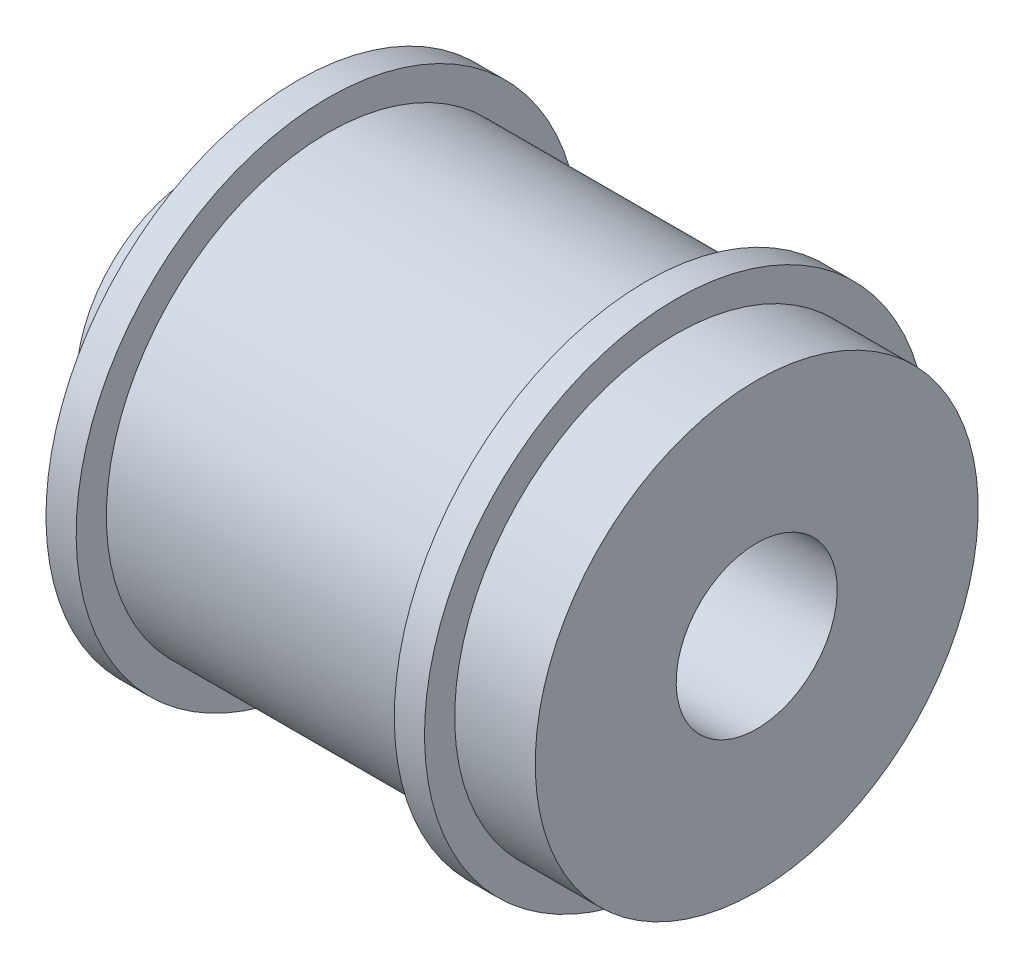
ISO-10303-21;
HEADER;
FILE_DESCRIPTION(('STEP AP214'),'2;1');
FILE_NAME('part.step','',(''),(''),'','','');
FILE_SCHEMA(('AUTOMOTIVE_DESIGN { 1 0 10303 214 1 1 1 1 }'));
ENDSEC;
DATA;
#1=APPLICATION_CONTEXT('core data for automotive mechanical design processes');
#2=APPLICATION_PROTOCOL_DEFINITION('international standard','automotive_design',2000,#1);
#3=PRODUCT_CONTEXT('',#1,'mechanical');
#4=PRODUCT('Part','Part','',(#3));
#5=PRODUCT_RELATED_PRODUCT_CATEGORY('part','',(#4));
#6=PRODUCT_DEFINITION_FORMATION('','',#4);
#7=PRODUCT_DEFINITION_CONTEXT('part definition',#1,'design');
#8=PRODUCT_DEFINITION('design','',#6,#7);
#9=PRODUCT_DEFINITION_SHAPE('','',#8);
#10=(LENGTH_UNIT() NAMED_UNIT(*) SI_UNIT(.MILLI.,.METRE.));
#11=(NAMED_UNIT(*) PLANE_ANGLE_UNIT() SI_UNIT($,.RADIAN.));
#12=(NAMED_UNIT(*) SI_UNIT($,.STERADIAN.) SOLID_ANGLE_UNIT());
#13=UNCERTAINTY_MEASURE_WITH_UNIT(LENGTH_MEASURE(1.E-05),#10,'distance_accuracy_value','');
#14=(GEOMETRIC_REPRESENTATION_CONTEXT(3) GLOBAL_UNCERTAINTY_ASSIGNED_CONTEXT((#13)) GLOBAL_UNIT_ASSIGNED_CONTEXT((#10,
#11,#12)) REPRESENTATION_CONTEXT('',''));
#15=CARTESIAN_POINT('',(0.,0.,0.));
#16=DIRECTION('',(0.,0.,1.));
#17=DIRECTION('',(1.,0.,0.));
#18=AXIS2_PLACEMENT_3D('',#15,#16,#17);
#19=CARTESIAN_POINT('',(0.,11.,0.));
#20=DIRECTION('',(1.,0.,0.));
#21=DIRECTION('',(0.,1.,0.));
#22=AXIS2_PLACEMENT_3D('',#19,#20,#21);
#23=PLANE('',#22);
#24=CARTESIAN_POINT('',(0.,0.,0.));
#25=DIRECTION('',(1.,0.,0.));
#26=DIRECTION('',(0.,1.,0.));
#27=AXIS2_PLACEMENT_3D('',#24,#25,#26);
#28=CIRCLE('',#27,11.);
#29=CARTESIAN_POINT('',(0.,11.,0.));
#30=VERTEX_POINT('',#29);
#31=EDGE_CURVE('E92',#30,#30,#28,.T.);
#32=ORIENTED_EDGE('',*,*,#31,.T.);
#33=EDGE_LOOP('',(#32));
#34=FACE_BOUND('',#33,.T.);
#35=CARTESIAN_POINT('',(0.,0.,0.));
#36=DIRECTION('',(1.,0.,0.));
#37=DIRECTION('',(0.,1.,0.));
#38=AXIS2_PLACEMENT_3D('',#35,#36,#37);
#39=CIRCLE('',#38,4.);
#40=CARTESIAN_POINT('',(0.,4.,0.));
#41=VERTEX_POINT('',#40);
#42=EDGE_CURVE('E10',#41,#41,#39,.T.);
#43=ORIENTED_EDGE('',*,*,#42,.F.);
#44=EDGE_LOOP('',(#43));
#45=FACE_BOUND('',#44,.T.);
#46=ADVANCED_FACE('F41',(#34,#45),#23,.T.);
#47=CARTESIAN_POINT('',(-9.77364607277416,0.,0.));
#48=DIRECTION('',(1.,0.,0.));
#49=DIRECTION('',(0.,1.,0.));
#50=AXIS2_PLACEMENT_3D('',#47,#48,#49);
#51=CYLINDRICAL_SURFACE('',#50,4.);
#52=ORIENTED_EDGE('',*,*,#42,.T.);
#53=EDGE_LOOP('',(#52));
#54=FACE_BOUND('',#53,.T.);
#55=CARTESIAN_POINT('',(-9.77364607277416,0.,0.));
#56=DIRECTION('',(1.,0.,0.));
#57=DIRECTION('',(0.,1.,0.));
#58=AXIS2_PLACEMENT_3D('',#55,#56,#57);
#59=CIRCLE('',#58,4.);
#60=CARTESIAN_POINT('',(-9.77364607277416,4.,0.));
#61=VERTEX_POINT('',#60);
#62=EDGE_CURVE('E48',#61,#61,#59,.T.);
#63=ORIENTED_EDGE('',*,*,#62,.F.);
#64=EDGE_LOOP('',(#63));
#65=FACE_BOUND('',#64,.T.);
#66=ADVANCED_FACE('F111',(#54,#65),#51,.F.);
#67=CARTESIAN_POINT('',(-9.77364607277416,4.,0.));
#68=DIRECTION('',(1.,0.,0.));
#69=DIRECTION('',(0.,1.,0.));
#70=AXIS2_PLACEMENT_3D('',#67,#68,#69);
#71=PLANE('',#70);
#72=ORIENTED_EDGE('',*,*,#62,.T.);
#73=EDGE_LOOP('',(#72));
#74=FACE_BOUND('',#73,.T.);
#75=ADVANCED_FACE('F115',(#74),#71,.T.);
#76=CARTESIAN_POINT('',(-27.8,6.,0.));
#77=DIRECTION('',(-1.,0.,0.));
#78=DIRECTION('',(0.,-1.,0.));
#79=AXIS2_PLACEMENT_3D('',#76,#77,#78);
#80=PLANE('',#79);
#81=CARTESIAN_POINT('',(-27.8,0.,0.));
#82=DIRECTION('',(1.,0.,0.));
#83=DIRECTION('',(0.,1.,0.));
#84=AXIS2_PLACEMENT_3D('',#81,#82,#83);
#85=CIRCLE('',#84,6.);
#86=CARTESIAN_POINT('',(-27.8,6.,0.));
#87=VERTEX_POINT('',#86);
#88=EDGE_CURVE('E53',#87,#87,#85,.T.);
#89=ORIENTED_EDGE('',*,*,#88,.F.);
#90=EDGE_LOOP('',(#89));
#91=FACE_BOUND('',#90,.T.);
#92=ADVANCED_FACE('F119',(#91),#80,.T.);
#93=CARTESIAN_POINT('',(-9.77364607277416,0.,0.));
#94=DIRECTION('',(1.,0.,0.));
#95=DIRECTION('',(0.,1.,0.));
#96=AXIS2_PLACEMENT_3D('',#93,#94,#95);
#97=CYLINDRICAL_SURFACE('',#96,6.);
#98=ORIENTED_EDGE('',*,*,#88,.T.);
#99=EDGE_LOOP('',(#98));
#100=FACE_BOUND('',#99,.T.);
#101=CARTESIAN_POINT('',(-22.8,0.,0.));
#102=DIRECTION('',(1.,0.,0.));
#103=DIRECTION('',(0.,1.,0.));
#104=AXIS2_PLACEMENT_3D('',#101,#102,#103);
#105=CIRCLE('',#104,6.);
#106=CARTESIAN_POINT('',(-22.8,6.,0.));
#107=VERTEX_POINT('',#106);
#108=EDGE_CURVE('E58',#107,#107,#105,.T.);
#109=ORIENTED_EDGE('',*,*,#108,.F.);
#110=EDGE_LOOP('',(#109));
#111=FACE_BOUND('',#110,.T.);
#112=ADVANCED_FACE('F125',(#100,#111),#97,.T.);
#113=CARTESIAN_POINT('',(-22.8,12.5,0.));
#114=DIRECTION('',(-1.,0.,0.));
#115=DIRECTION('',(0.,-1.,0.));
#116=AXIS2_PLACEMENT_3D('',#113,#114,#115);
#117=PLANE('',#116);
#118=ORIENTED_EDGE('',*,*,#108,.T.);
#119=EDGE_LOOP('',(#118));
#120=FACE_BOUND('',#119,.T.);
#121=CARTESIAN_POINT('',(-22.8,0.,0.));
#122=DIRECTION('',(1.,0.,0.));
#123=DIRECTION('',(0.,1.,0.));
#124=AXIS2_PLACEMENT_3D('',#121,#122,#123);
#125=CIRCLE('',#124,12.5);
#126=CARTESIAN_POINT('',(-22.8,12.5,0.));
#127=VERTEX_POINT('',#126);
#128=EDGE_CURVE('E64',#127,#127,#125,.T.);
#129=ORIENTED_EDGE('',*,*,#128,.F.);
#130=EDGE_LOOP('',(#129));
#131=FACE_BOUND('',#130,.T.);
#132=ADVANCED_FACE('F129',(#120,#131),#117,.T.);
#133=CARTESIAN_POINT('',(-9.77364607277416,0.,0.));
#134=DIRECTION('',(1.,0.,0.));
#135=DIRECTION('',(0.,1.,0.));
#136=AXIS2_PLACEMENT_3D('',#133,#134,#135);
#137=CYLINDRICAL_SURFACE('',#136,12.5);
#138=ORIENTED_EDGE('',*,*,#128,.T.);
#139=EDGE_LOOP('',(#138));
#140=FACE_BOUND('',#139,.T.);
#141=CARTESIAN_POINT('',(-21.3,0.,0.));
#142=DIRECTION('',(1.,0.,0.));
#143=DIRECTION('',(0.,1.,0.));
#144=AXIS2_PLACEMENT_3D('',#141,#142,#143);
#145=CIRCLE('',#144,12.5);
#146=CARTESIAN_POINT('',(-21.3,12.5,0.));
#147=VERTEX_POINT('',#146);
#148=EDGE_CURVE('E68',#147,#147,#145,.T.);
#149=ORIENTED_EDGE('',*,*,#148,.F.);
#150=EDGE_LOOP('',(#149));
#151=FACE_BOUND('',#150,.T.);
#152=ADVANCED_FACE('F133',(#140,#151),#137,.T.);
#153=CARTESIAN_POINT('',(-21.3,11.,0.));
#154=DIRECTION('',(1.,0.,0.));
#155=DIRECTION('',(0.,1.,0.));
#156=AXIS2_PLACEMENT_3D('',#153,#154,#155);
#157=PLANE('',#156);
#158=ORIENTED_EDGE('',*,*,#148,.T.);
#159=EDGE_LOOP('',(#158));
#160=FACE_BOUND('',#159,.T.);
#161=CARTESIAN_POINT('',(-21.3,0.,0.));
#162=DIRECTION('',(1.,0.,0.));
#163=DIRECTION('',(0.,1.,0.));
#164=AXIS2_PLACEMENT_3D('',#161,#162,#163);
#165=CIRCLE('',#164,11.);
#166=CARTESIAN_POINT('',(-21.3,11.,0.));
#167=VERTEX_POINT('',#166);
#168=EDGE_CURVE('E72',#167,#167,#165,.T.);
#169=ORIENTED_EDGE('',*,*,#168,.F.);
#170=EDGE_LOOP('',(#169));
#171=FACE_BOUND('',#170,.T.);
#172=ADVANCED_FACE('F137',(#160,#171),#157,.T.);
#173=CARTESIAN_POINT('',(-9.77364607277416,0.,0.));
#174=DIRECTION('',(1.,0.,0.));
#175=DIRECTION('',(0.,1.,0.));
#176=AXIS2_PLACEMENT_3D('',#173,#174,#175);
#177=CYLINDRICAL_SURFACE('',#176,11.);
#178=ORIENTED_EDGE('',*,*,#168,.T.);
#179=EDGE_LOOP('',(#178));
#180=FACE_BOUND('',#179,.T.);
#181=CARTESIAN_POINT('',(-5.5,0.,0.));
#182=DIRECTION('',(1.,0.,0.));
#183=DIRECTION('',(0.,1.,0.));
#184=AXIS2_PLACEMENT_3D('',#181,#182,#183);
#185=CIRCLE('',#184,11.);
#186=CARTESIAN_POINT('',(-5.5,11.,0.));
#187=VERTEX_POINT('',#186);
#188=EDGE_CURVE('E76',#187,#187,#185,.T.);
#189=ORIENTED_EDGE('',*,*,#188,.F.);
#190=EDGE_LOOP('',(#189));
#191=FACE_BOUND('',#190,.T.);
#192=ADVANCED_FACE('F141',(#180,#191),#177,.T.);
#193=CARTESIAN_POINT('',(-5.5,12.5,0.));
#194=DIRECTION('',(-1.,0.,0.));
#195=DIRECTION('',(0.,-1.,0.));
#196=AXIS2_PLACEMENT_3D('',#193,#194,#195);
#197=PLANE('',#196);
#198=ORIENTED_EDGE('',*,*,#188,.T.);
#199=EDGE_LOOP('',(#198));
#200=FACE_BOUND('',#199,.T.);
#201=CARTESIAN_POINT('',(-5.5,0.,0.));
#202=DIRECTION('',(1.,0.,0.));
#203=DIRECTION('',(0.,1.,0.));
#204=AXIS2_PLACEMENT_3D('',#201,#202,#203);
#205=CIRCLE('',#204,12.5);
#206=CARTESIAN_POINT('',(-5.5,12.5,0.));
#207=VERTEX_POINT('',#206);
#208=EDGE_CURVE('E80',#207,#207,#205,.T.);
#209=ORIENTED_EDGE('',*,*,#208,.F.);
#210=EDGE_LOOP('',(#209));
#211=FACE_BOUND('',#210,.T.);
#212=ADVANCED_FACE('F145',(#200,#211),#197,.T.);
#213=CARTESIAN_POINT('',(-9.77364607277416,0.,0.));
#214=DIRECTION('',(1.,0.,0.));
#215=DIRECTION('',(0.,1.,0.));
#216=AXIS2_PLACEMENT_3D('',#213,#214,#215);
#217=CYLINDRICAL_SURFACE('',#216,12.5);
#218=ORIENTED_EDGE('',*,*,#208,.T.);
#219=EDGE_LOOP('',(#218));
#220=FACE_BOUND('',#219,.T.);
#221=CARTESIAN_POINT('',(-4.,0.,0.));
#222=DIRECTION('',(1.,0.,0.));
#223=DIRECTION('',(0.,1.,0.));
#224=AXIS2_PLACEMENT_3D('',#221,#222,#223);
#225=CIRCLE('',#224,12.5);
#226=CARTESIAN_POINT('',(-4.,12.5,0.));
#227=VERTEX_POINT('',#226);
#228=EDGE_CURVE('E84',#227,#227,#225,.T.);
#229=ORIENTED_EDGE('',*,*,#228,.F.);
#230=EDGE_LOOP('',(#229));
#231=FACE_BOUND('',#230,.T.);
#232=ADVANCED_FACE('F107',(#220,#231),#217,.T.);
#233=CARTESIAN_POINT('',(-4.,11.,0.));
#234=DIRECTION('',(1.,0.,0.));
#235=DIRECTION('',(0.,1.,0.));
#236=AXIS2_PLACEMENT_3D('',#233,#234,#235);
#237=PLANE('',#236);
#238=ORIENTED_EDGE('',*,*,#228,.T.);
#239=EDGE_LOOP('',(#238));
#240=FACE_BOUND('',#239,.T.);
#241=CARTESIAN_POINT('',(-4.,0.,0.));
#242=DIRECTION('',(1.,0.,0.));
#243=DIRECTION('',(0.,1.,0.));
#244=AXIS2_PLACEMENT_3D('',#241,#242,#243);
#245=CIRCLE('',#244,11.);
#246=CARTESIAN_POINT('',(-4.,11.,0.));
#247=VERTEX_POINT('',#246);
#248=EDGE_CURVE('E88',#247,#247,#245,.T.);
#249=ORIENTED_EDGE('',*,*,#248,.F.);
#250=EDGE_LOOP('',(#249));
#251=FACE_BOUND('',#250,.T.);
#252=ADVANCED_FACE('F101',(#240,#251),#237,.T.);
#253=CARTESIAN_POINT('',(-9.77364607277416,0.,0.));
#254=DIRECTION('',(1.,0.,0.));
#255=DIRECTION('',(0.,1.,0.));
#256=AXIS2_PLACEMENT_3D('',#253,#254,#255);
#257=CYLINDRICAL_SURFACE('',#256,11.);
#258=ORIENTED_EDGE('',*,*,#248,.T.);
#259=EDGE_LOOP('',(#258));
#260=FACE_BOUND('',#259,.T.);
#261=ORIENTED_EDGE('',*,*,#31,.F.);
#262=EDGE_LOOP('',(#261));
#263=FACE_BOUND('',#262,.T.);
#264=ADVANCED_FACE('F99',(#260,#263),#257,.T.);
#265=CLOSED_SHELL('',(#46,#66,#75,#92,#112,#132,#152,#172,#192,#212,#232,#252,#264));
#266=MANIFOLD_SOLID_BREP('B2',#265);
#267=ADVANCED_BREP_SHAPE_REPRESENTATION('',(#18,#266),#14);
#268=SHAPE_DEFINITION_REPRESENTATION(#9,#267);
ENDSEC;
END-ISO-10303-21;
